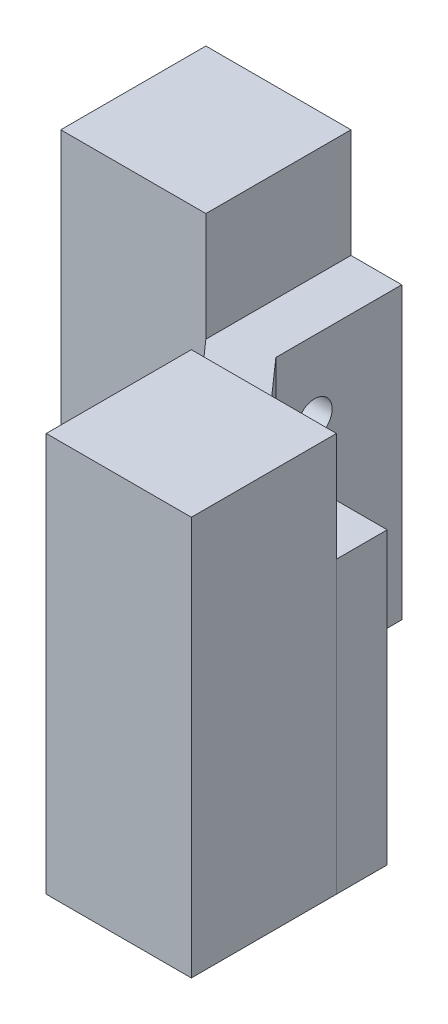
ISO-10303-21;
HEADER;
FILE_DESCRIPTION(('STEP AP214'),'2;1');
FILE_NAME('part.step','',(''),(''),'','','');
FILE_SCHEMA(('AUTOMOTIVE_DESIGN { 1 0 10303 214 1 1 1 1 }'));
ENDSEC;
DATA;
#1=APPLICATION_CONTEXT('core data for automotive mechanical design processes');
#2=APPLICATION_PROTOCOL_DEFINITION('international standard','automotive_design',2000,#1);
#3=PRODUCT_CONTEXT('',#1,'mechanical');
#4=PRODUCT('Part','Part','',(#3));
#5=PRODUCT_RELATED_PRODUCT_CATEGORY('part','',(#4));
#6=PRODUCT_DEFINITION_FORMATION('','',#4);
#7=PRODUCT_DEFINITION_CONTEXT('part definition',#1,'design');
#8=PRODUCT_DEFINITION('design','',#6,#7);
#9=PRODUCT_DEFINITION_SHAPE('','',#8);
#10=(LENGTH_UNIT() NAMED_UNIT(*) SI_UNIT(.MILLI.,.METRE.));
#11=(NAMED_UNIT(*) PLANE_ANGLE_UNIT() SI_UNIT($,.RADIAN.));
#12=(NAMED_UNIT(*) SI_UNIT($,.STERADIAN.) SOLID_ANGLE_UNIT());
#13=UNCERTAINTY_MEASURE_WITH_UNIT(LENGTH_MEASURE(1.E-05),#10,'distance_accuracy_value','');
#14=(GEOMETRIC_REPRESENTATION_CONTEXT(3) GLOBAL_UNCERTAINTY_ASSIGNED_CONTEXT((#13)) GLOBAL_UNIT_ASSIGNED_CONTEXT((#10,
#11,#12)) REPRESENTATION_CONTEXT('',''));
#15=CARTESIAN_POINT('',(0.,0.,0.));
#16=DIRECTION('',(0.,0.,1.));
#17=DIRECTION('',(1.,0.,0.));
#18=AXIS2_PLACEMENT_3D('',#15,#16,#17);
#19=CARTESIAN_POINT('',(15.25,40.,17.25));
#20=DIRECTION('',(0.,0.,-1.));
#21=DIRECTION('',(-1.,0.,0.));
#22=AXIS2_PLACEMENT_3D('',#19,#20,#21);
#23=PLANE('',#22);
#24=CARTESIAN_POINT('',(25.25,30.,17.25));
#25=DIRECTION('',(0.,0.,-1.));
#26=DIRECTION('',(-1.,0.,0.));
#27=AXIS2_PLACEMENT_3D('',#24,#25,#26);
#28=CIRCLE('',#27,2.4);
#29=CARTESIAN_POINT('',(22.85,30.,17.25));
#30=VERTEX_POINT('',#29);
#31=EDGE_CURVE('E229',#30,#30,#28,.T.);
#32=ORIENTED_EDGE('',*,*,#31,.T.);
#33=EDGE_LOOP('',(#32));
#34=FACE_BOUND('',#33,.T.);
#35=CARTESIAN_POINT('',(25.25,10.,17.25));
#36=DIRECTION('',(0.,0.,-1.));
#37=DIRECTION('',(-1.,0.,0.));
#38=AXIS2_PLACEMENT_3D('',#35,#36,#37);
#39=CIRCLE('',#38,2.4);
#40=CARTESIAN_POINT('',(22.85,10.,17.25));
#41=VERTEX_POINT('',#40);
#42=EDGE_CURVE('E162',#41,#41,#39,.T.);
#43=ORIENTED_EDGE('',*,*,#42,.T.);
#44=EDGE_LOOP('',(#43));
#45=FACE_BOUND('',#44,.T.);
#46=DIRECTION('',(1.,0.,0.));
#47=VECTOR('',#46,1.);
#48=CARTESIAN_POINT('',(15.25,0.,17.25));
#49=LINE('',#48,#47);
#50=CARTESIAN_POINT('',(15.25,0.,17.25));
#51=VERTEX_POINT('',#50);
#52=CARTESIAN_POINT('',(35.25,0.,17.25));
#53=VERTEX_POINT('',#52);
#54=EDGE_CURVE('E157',#51,#53,#49,.T.);
#55=ORIENTED_EDGE('',*,*,#54,.T.);
#56=DIRECTION('',(0.,-1.,0.));
#57=VECTOR('',#56,1.);
#58=CARTESIAN_POINT('',(35.25,40.,17.25));
#59=LINE('',#58,#57);
#60=CARTESIAN_POINT('',(35.25,40.,17.25));
#61=VERTEX_POINT('',#60);
#62=EDGE_CURVE('E12',#61,#53,#59,.T.);
#63=ORIENTED_EDGE('',*,*,#62,.F.);
#64=DIRECTION('',(1.,0.,0.));
#65=VECTOR('',#64,1.);
#66=CARTESIAN_POINT('',(15.25,40.,17.25));
#67=LINE('',#66,#65);
#68=CARTESIAN_POINT('',(15.25,40.,17.25));
#69=VERTEX_POINT('',#68);
#70=EDGE_CURVE('E108',#69,#61,#67,.T.);
#71=ORIENTED_EDGE('',*,*,#70,.F.);
#72=DIRECTION('',(0.,-1.,0.));
#73=VECTOR('',#72,1.);
#74=CARTESIAN_POINT('',(15.25,40.,17.25));
#75=LINE('',#74,#73);
#76=EDGE_CURVE('E156',#69,#51,#75,.T.);
#77=ORIENTED_EDGE('',*,*,#76,.T.);
#78=EDGE_LOOP('',(#55,#63,#71,#77));
#79=FACE_BOUND('',#78,.T.);
#80=ADVANCED_FACE('F52',(#34,#45,#79),#23,.F.);
#81=CARTESIAN_POINT('',(35.25,40.,10.25));
#82=DIRECTION('',(1.,0.,0.));
#83=DIRECTION('',(0.,0.,-1.));
#84=AXIS2_PLACEMENT_3D('',#81,#82,#83);
#85=PLANE('',#84);
#86=DIRECTION('',(0.,0.,1.));
#87=VECTOR('',#86,1.);
#88=CARTESIAN_POINT('',(35.25,0.,10.25));
#89=LINE('',#88,#87);
#90=CARTESIAN_POINT('',(35.25,0.,10.25));
#91=VERTEX_POINT('',#90);
#92=EDGE_CURVE('E161',#91,#53,#89,.T.);
#93=ORIENTED_EDGE('',*,*,#92,.F.);
#94=DIRECTION('',(0.,-1.,0.));
#95=VECTOR('',#94,1.);
#96=CARTESIAN_POINT('',(35.25,40.,10.25));
#97=LINE('',#96,#95);
#98=CARTESIAN_POINT('',(35.25,40.,10.25));
#99=VERTEX_POINT('',#98);
#100=EDGE_CURVE('E61',#99,#91,#97,.T.);
#101=ORIENTED_EDGE('',*,*,#100,.F.);
#102=DIRECTION('',(0.,0.,1.));
#103=VECTOR('',#102,1.);
#104=CARTESIAN_POINT('',(35.25,40.,10.25));
#105=LINE('',#104,#103);
#106=EDGE_CURVE('E213',#99,#61,#105,.T.);
#107=ORIENTED_EDGE('',*,*,#106,.T.);
#108=ORIENTED_EDGE('',*,*,#62,.T.);
#109=EDGE_LOOP('',(#93,#101,#107,#108));
#110=FACE_BOUND('',#109,.T.);
#111=ADVANCED_FACE('F204',(#110),#85,.T.);
#112=CARTESIAN_POINT('',(15.25,40.,10.25));
#113=DIRECTION('',(0.,0.,-1.));
#114=DIRECTION('',(-1.,0.,0.));
#115=AXIS2_PLACEMENT_3D('',#112,#113,#114);
#116=PLANE('',#115);
#117=CARTESIAN_POINT('',(25.25,30.,10.25));
#118=DIRECTION('',(0.,0.,-1.));
#119=DIRECTION('',(-1.,0.,0.));
#120=AXIS2_PLACEMENT_3D('',#117,#118,#119);
#121=CIRCLE('',#120,2.4);
#122=CARTESIAN_POINT('',(22.85,30.,10.25));
#123=VERTEX_POINT('',#122);
#124=EDGE_CURVE('E233',#123,#123,#121,.T.);
#125=ORIENTED_EDGE('',*,*,#124,.F.);
#126=EDGE_LOOP('',(#125));
#127=FACE_BOUND('',#126,.T.);
#128=CARTESIAN_POINT('',(25.25,10.,10.25));
#129=DIRECTION('',(0.,0.,-1.));
#130=DIRECTION('',(-1.,0.,0.));
#131=AXIS2_PLACEMENT_3D('',#128,#129,#130);
#132=CIRCLE('',#131,2.4);
#133=CARTESIAN_POINT('',(22.85,10.,10.25));
#134=VERTEX_POINT('',#133);
#135=EDGE_CURVE('E226',#134,#134,#132,.T.);
#136=ORIENTED_EDGE('',*,*,#135,.F.);
#137=EDGE_LOOP('',(#136));
#138=FACE_BOUND('',#137,.T.);
#139=DIRECTION('',(1.,0.,0.));
#140=VECTOR('',#139,1.);
#141=CARTESIAN_POINT('',(15.25,0.,10.25));
#142=LINE('',#141,#140);
#143=CARTESIAN_POINT('',(18.4048466510345,0.,10.25));
#144=VERTEX_POINT('',#143);
#145=EDGE_CURVE('E166',#144,#91,#142,.T.);
#146=ORIENTED_EDGE('',*,*,#145,.F.);
#147=DIRECTION('',(0.,-1.,0.));
#148=VECTOR('',#147,1.);
#149=CARTESIAN_POINT('',(18.4048466510345,40.,10.25));
#150=LINE('',#149,#148);
#151=CARTESIAN_POINT('',(18.4048466510345,40.,10.25));
#152=VERTEX_POINT('',#151);
#153=EDGE_CURVE('E192',#152,#144,#150,.T.);
#154=ORIENTED_EDGE('',*,*,#153,.F.);
#155=DIRECTION('',(1.,0.,0.));
#156=VECTOR('',#155,1.);
#157=CARTESIAN_POINT('',(15.25,40.,10.25));
#158=LINE('',#157,#156);
#159=EDGE_CURVE('E201',#152,#99,#158,.T.);
#160=ORIENTED_EDGE('',*,*,#159,.T.);
#161=ORIENTED_EDGE('',*,*,#100,.T.);
#162=EDGE_LOOP('',(#146,#154,#160,#161));
#163=FACE_BOUND('',#162,.T.);
#164=ADVANCED_FACE('F199',(#127,#138,#163),#116,.T.);
#165=CARTESIAN_POINT('',(5.24442642131282,40.,-4.63637698116061));
#166=DIRECTION('',(0.74920377447326,0.,-0.66233956873723));
#167=DIRECTION('',(-0.66233956873723,0.,-0.74920377447326));
#168=AXIS2_PLACEMENT_3D('',#165,#166,#167);
#169=PLANE('',#168);
#170=DIRECTION('',(0.66233956873723,0.,0.74920377447326));
#171=VECTOR('',#170,1.);
#172=CARTESIAN_POINT('',(5.24442642131282,0.,-4.63637698116061));
#173=LINE('',#172,#171);
#174=CARTESIAN_POINT('',(7.,0.,-2.65056424461282));
#175=VERTEX_POINT('',#174);
#176=EDGE_CURVE('E170',#175,#144,#173,.T.);
#177=ORIENTED_EDGE('',*,*,#176,.F.);
#178=DIRECTION('',(0.,-1.,0.));
#179=VECTOR('',#178,1.);
#180=CARTESIAN_POINT('',(7.,40.,-2.65056424461282));
#181=LINE('',#180,#179);
#182=CARTESIAN_POINT('',(7.,40.,-2.65056424461282));
#183=VERTEX_POINT('',#182);
#184=EDGE_CURVE('E189',#183,#175,#181,.T.);
#185=ORIENTED_EDGE('',*,*,#184,.F.);
#186=DIRECTION('',(0.66233956873723,0.,0.74920377447326));
#187=VECTOR('',#186,1.);
#188=CARTESIAN_POINT('',(5.24442642131282,40.,-4.63637698116061));
#189=LINE('',#188,#187);
#190=EDGE_CURVE('E150',#183,#152,#189,.T.);
#191=ORIENTED_EDGE('',*,*,#190,.T.);
#192=ORIENTED_EDGE('',*,*,#153,.T.);
#193=EDGE_LOOP('',(#177,#185,#191,#192));
#194=FACE_BOUND('',#193,.T.);
#195=ADVANCED_FACE('F211',(#194),#169,.T.);
#196=CARTESIAN_POINT('',(7.,40.,-20.));
#197=DIRECTION('',(1.,0.,0.));
#198=DIRECTION('',(0.,0.,-1.));
#199=AXIS2_PLACEMENT_3D('',#196,#197,#198);
#200=PLANE('',#199);
#201=CARTESIAN_POINT('',(7.,30.,-7.99999999999999));
#202=DIRECTION('',(1.,0.,0.));
#203=DIRECTION('',(0.,0.,-1.));
#204=AXIS2_PLACEMENT_3D('',#201,#202,#203);
#205=CIRCLE('',#204,2.4);
#206=CARTESIAN_POINT('',(7.00000000000001,30.,-10.4));
#207=VERTEX_POINT('',#206);
#208=EDGE_CURVE('E249',#207,#207,#205,.T.);
#209=ORIENTED_EDGE('',*,*,#208,.F.);
#210=EDGE_LOOP('',(#209));
#211=FACE_BOUND('',#210,.T.);
#212=CARTESIAN_POINT('',(7.,10.,-7.99999999999999));
#213=DIRECTION('',(1.,0.,0.));
#214=DIRECTION('',(0.,0.,-1.));
#215=AXIS2_PLACEMENT_3D('',#212,#213,#214);
#216=CIRCLE('',#215,2.4);
#217=CARTESIAN_POINT('',(7.00000000000001,10.,-10.4));
#218=VERTEX_POINT('',#217);
#219=EDGE_CURVE('E241',#218,#218,#216,.T.);
#220=ORIENTED_EDGE('',*,*,#219,.F.);
#221=EDGE_LOOP('',(#220));
#222=FACE_BOUND('',#221,.T.);
#223=DIRECTION('',(0.,0.,1.));
#224=VECTOR('',#223,1.);
#225=CARTESIAN_POINT('',(7.,0.,-20.));
#226=LINE('',#225,#224);
#227=CARTESIAN_POINT('',(7.,0.,-20.));
#228=VERTEX_POINT('',#227);
#229=EDGE_CURVE('E174',#228,#175,#226,.T.);
#230=ORIENTED_EDGE('',*,*,#229,.F.);
#231=DIRECTION('',(0.,-1.,0.));
#232=VECTOR('',#231,1.);
#233=CARTESIAN_POINT('',(7.,40.,-20.));
#234=LINE('',#233,#232);
#235=CARTESIAN_POINT('',(7.,40.,-20.));
#236=VERTEX_POINT('',#235);
#237=EDGE_CURVE('E133',#236,#228,#234,.T.);
#238=ORIENTED_EDGE('',*,*,#237,.F.);
#239=DIRECTION('',(0.,0.,1.));
#240=VECTOR('',#239,1.);
#241=CARTESIAN_POINT('',(7.,40.,-20.));
#242=LINE('',#241,#240);
#243=EDGE_CURVE('E144',#236,#183,#242,.T.);
#244=ORIENTED_EDGE('',*,*,#243,.T.);
#245=ORIENTED_EDGE('',*,*,#184,.T.);
#246=EDGE_LOOP('',(#230,#238,#244,#245));
#247=FACE_BOUND('',#246,.T.);
#248=ADVANCED_FACE('F255',(#211,#222,#247),#200,.T.);
#249=CARTESIAN_POINT('',(0.,40.,-20.));
#250=DIRECTION('',(0.,0.,-1.));
#251=DIRECTION('',(-1.,0.,0.));
#252=AXIS2_PLACEMENT_3D('',#249,#250,#251);
#253=PLANE('',#252);
#254=DIRECTION('',(1.,0.,0.));
#255=VECTOR('',#254,1.);
#256=CARTESIAN_POINT('',(0.,0.,-20.));
#257=LINE('',#256,#255);
#258=CARTESIAN_POINT('',(0.,0.,-20.));
#259=VERTEX_POINT('',#258);
#260=EDGE_CURVE('E131',#259,#228,#257,.T.);
#261=ORIENTED_EDGE('',*,*,#260,.F.);
#262=DIRECTION('',(0.,-1.,0.));
#263=VECTOR('',#262,1.);
#264=CARTESIAN_POINT('',(0.,40.,-20.));
#265=LINE('',#264,#263);
#266=CARTESIAN_POINT('',(0.,40.,-20.));
#267=VERTEX_POINT('',#266);
#268=EDGE_CURVE('E125',#267,#259,#265,.T.);
#269=ORIENTED_EDGE('',*,*,#268,.F.);
#270=DIRECTION('',(1.,0.,0.));
#271=VECTOR('',#270,1.);
#272=CARTESIAN_POINT('',(0.,40.,-20.));
#273=LINE('',#272,#271);
#274=EDGE_CURVE('E129',#267,#236,#273,.T.);
#275=ORIENTED_EDGE('',*,*,#274,.T.);
#276=ORIENTED_EDGE('',*,*,#237,.T.);
#277=EDGE_LOOP('',(#261,#269,#275,#276));
#278=FACE_BOUND('',#277,.T.);
#279=ADVANCED_FACE('F127',(#278),#253,.T.);
#280=CARTESIAN_POINT('',(0.,40.,-20.));
#281=DIRECTION('',(1.,0.,0.));
#282=DIRECTION('',(0.,0.,-1.));
#283=AXIS2_PLACEMENT_3D('',#280,#281,#282);
#284=PLANE('',#283);
#285=CARTESIAN_POINT('',(0.,30.,-8.));
#286=DIRECTION('',(1.,0.,0.));
#287=DIRECTION('',(0.,0.,-1.));
#288=AXIS2_PLACEMENT_3D('',#285,#286,#287);
#289=CIRCLE('',#288,2.4);
#290=CARTESIAN_POINT('',(0.,30.,-10.4));
#291=VERTEX_POINT('',#290);
#292=EDGE_CURVE('E245',#291,#291,#289,.T.);
#293=ORIENTED_EDGE('',*,*,#292,.T.);
#294=EDGE_LOOP('',(#293));
#295=FACE_BOUND('',#294,.T.);
#296=CARTESIAN_POINT('',(0.,10.,-8.));
#297=DIRECTION('',(1.,0.,0.));
#298=DIRECTION('',(0.,0.,-1.));
#299=AXIS2_PLACEMENT_3D('',#296,#297,#298);
#300=CIRCLE('',#299,2.4);
#301=CARTESIAN_POINT('',(0.,10.,-10.4));
#302=VERTEX_POINT('',#301);
#303=EDGE_CURVE('E237',#302,#302,#300,.T.);
#304=ORIENTED_EDGE('',*,*,#303,.T.);
#305=EDGE_LOOP('',(#304));
#306=FACE_BOUND('',#305,.T.);
#307=DIRECTION('',(0.,0.,1.));
#308=VECTOR('',#307,1.);
#309=CARTESIAN_POINT('',(0.,0.,-20.));
#310=LINE('',#309,#308);
#311=CARTESIAN_POINT('',(0.,0.,0.));
#312=VERTEX_POINT('',#311);
#313=EDGE_CURVE('E96',#259,#312,#310,.T.);
#314=ORIENTED_EDGE('',*,*,#313,.T.);
#315=DIRECTION('',(0.,-1.,0.));
#316=VECTOR('',#315,1.);
#317=CARTESIAN_POINT('',(0.,40.,0.));
#318=LINE('',#317,#316);
#319=CARTESIAN_POINT('',(0.,40.,0.));
#320=VERTEX_POINT('',#319);
#321=EDGE_CURVE('E134',#320,#312,#318,.T.);
#322=ORIENTED_EDGE('',*,*,#321,.F.);
#323=DIRECTION('',(0.,0.,1.));
#324=VECTOR('',#323,1.);
#325=CARTESIAN_POINT('',(0.,40.,-20.));
#326=LINE('',#325,#324);
#327=EDGE_CURVE('E136',#267,#320,#326,.T.);
#328=ORIENTED_EDGE('',*,*,#327,.F.);
#329=ORIENTED_EDGE('',*,*,#268,.T.);
#330=EDGE_LOOP('',(#314,#322,#328,#329));
#331=FACE_BOUND('',#330,.T.);
#332=ADVANCED_FACE('F137',(#295,#306,#331),#284,.F.);
#333=CARTESIAN_POINT('',(0.,40.,0.));
#334=DIRECTION('',(0.74920377447326,0.,-0.66233956873723));
#335=DIRECTION('',(-0.66233956873723,0.,-0.74920377447326));
#336=AXIS2_PLACEMENT_3D('',#333,#334,#335);
#337=PLANE('',#336);
#338=DIRECTION('',(0.66233956873723,0.,0.74920377447326));
#339=VECTOR('',#338,1.);
#340=CARTESIAN_POINT('',(0.,0.,0.));
#341=LINE('',#340,#339);
#342=EDGE_CURVE('E102',#312,#51,#341,.T.);
#343=ORIENTED_EDGE('',*,*,#342,.T.);
#344=ORIENTED_EDGE('',*,*,#76,.F.);
#345=DIRECTION('',(0.66233956873723,0.,0.74920377447326));
#346=VECTOR('',#345,1.);
#347=CARTESIAN_POINT('',(0.,40.,0.));
#348=LINE('',#347,#346);
#349=EDGE_CURVE('E69',#320,#69,#348,.T.);
#350=ORIENTED_EDGE('',*,*,#349,.F.);
#351=ORIENTED_EDGE('',*,*,#321,.T.);
#352=EDGE_LOOP('',(#343,#344,#350,#351));
#353=FACE_BOUND('',#352,.T.);
#354=ADVANCED_FACE('F262',(#353),#337,.F.);
#355=CARTESIAN_POINT('',(0.,40.,0.));
#356=DIRECTION('',(0.,-1.,0.));
#357=DIRECTION('',(-1.,0.,0.));
#358=AXIS2_PLACEMENT_3D('',#355,#356,#357);
#359=PLANE('',#358);
#360=ORIENTED_EDGE('',*,*,#70,.T.);
#361=ORIENTED_EDGE('',*,*,#106,.F.);
#362=ORIENTED_EDGE('',*,*,#159,.F.);
#363=ORIENTED_EDGE('',*,*,#190,.F.);
#364=ORIENTED_EDGE('',*,*,#243,.F.);
#365=ORIENTED_EDGE('',*,*,#274,.F.);
#366=ORIENTED_EDGE('',*,*,#327,.T.);
#367=ORIENTED_EDGE('',*,*,#349,.T.);
#368=EDGE_LOOP('',(#360,#361,#362,#363,#364,#365,#366,#367));
#369=FACE_BOUND('',#368,.T.);
#370=ADVANCED_FACE('F141',(#369),#359,.F.);
#371=CARTESIAN_POINT('',(0.,0.,0.));
#372=DIRECTION('',(0.,-1.,0.));
#373=DIRECTION('',(-1.,0.,0.));
#374=AXIS2_PLACEMENT_3D('',#371,#372,#373);
#375=PLANE('',#374);
#376=ORIENTED_EDGE('',*,*,#54,.F.);
#377=ORIENTED_EDGE('',*,*,#342,.F.);
#378=ORIENTED_EDGE('',*,*,#313,.F.);
#379=ORIENTED_EDGE('',*,*,#260,.T.);
#380=ORIENTED_EDGE('',*,*,#229,.T.);
#381=ORIENTED_EDGE('',*,*,#176,.T.);
#382=ORIENTED_EDGE('',*,*,#145,.T.);
#383=ORIENTED_EDGE('',*,*,#92,.T.);
#384=EDGE_LOOP('',(#376,#377,#378,#379,#380,#381,#382,#383));
#385=FACE_BOUND('',#384,.T.);
#386=ADVANCED_FACE('F207',(#385),#375,.T.);
#387=CARTESIAN_POINT('',(25.25,10.,10.25));
#388=DIRECTION('',(0.,0.,-1.));
#389=DIRECTION('',(-1.,0.,0.));
#390=AXIS2_PLACEMENT_3D('',#387,#388,#389);
#391=CYLINDRICAL_SURFACE('',#390,2.4);
#392=ORIENTED_EDGE('',*,*,#135,.T.);
#393=EDGE_LOOP('',(#392));
#394=FACE_BOUND('',#393,.T.);
#395=ORIENTED_EDGE('',*,*,#42,.F.);
#396=EDGE_LOOP('',(#395));
#397=FACE_BOUND('',#396,.T.);
#398=ADVANCED_FACE('F282',(#394,#397),#391,.F.);
#399=CARTESIAN_POINT('',(25.25,30.,10.25));
#400=DIRECTION('',(0.,0.,-1.));
#401=DIRECTION('',(-1.,0.,0.));
#402=AXIS2_PLACEMENT_3D('',#399,#400,#401);
#403=CYLINDRICAL_SURFACE('',#402,2.4);
#404=ORIENTED_EDGE('',*,*,#124,.T.);
#405=EDGE_LOOP('',(#404));
#406=FACE_BOUND('',#405,.T.);
#407=ORIENTED_EDGE('',*,*,#31,.F.);
#408=EDGE_LOOP('',(#407));
#409=FACE_BOUND('',#408,.T.);
#410=ADVANCED_FACE('F284',(#406,#409),#403,.F.);
#411=CARTESIAN_POINT('',(7.,10.,-7.99999999999999));
#412=DIRECTION('',(1.,0.,0.));
#413=DIRECTION('',(0.,0.,-1.));
#414=AXIS2_PLACEMENT_3D('',#411,#412,#413);
#415=CYLINDRICAL_SURFACE('',#414,2.4);
#416=ORIENTED_EDGE('',*,*,#303,.F.);
#417=EDGE_LOOP('',(#416));
#418=FACE_BOUND('',#417,.T.);
#419=ORIENTED_EDGE('',*,*,#219,.T.);
#420=EDGE_LOOP('',(#419));
#421=FACE_BOUND('',#420,.T.);
#422=ADVANCED_FACE('F291',(#418,#421),#415,.F.);
#423=CARTESIAN_POINT('',(7.,30.,-7.99999999999999));
#424=DIRECTION('',(1.,0.,0.));
#425=DIRECTION('',(0.,0.,-1.));
#426=AXIS2_PLACEMENT_3D('',#423,#424,#425);
#427=CYLINDRICAL_SURFACE('',#426,2.4);
#428=ORIENTED_EDGE('',*,*,#292,.F.);
#429=EDGE_LOOP('',(#428));
#430=FACE_BOUND('',#429,.T.);
#431=ORIENTED_EDGE('',*,*,#208,.T.);
#432=EDGE_LOOP('',(#431));
#433=FACE_BOUND('',#432,.T.);
#434=ADVANCED_FACE('F253',(#430,#433),#427,.F.);
#435=CLOSED_SHELL('',(#80,#111,#164,#195,#248,#279,#332,#354,#370,#386,#398,#410,#422,#434));
#436=MANIFOLD_SOLID_BREP('B2',#435);
#437=CARTESIAN_POINT('',(15.25,55.,17.25));
#438=DIRECTION('',(1.,0.,0.));
#439=DIRECTION('',(0.,0.,-1.));
#440=AXIS2_PLACEMENT_3D('',#437,#438,#439);
#441=PLANE('',#440);
#442=DIRECTION('',(0.,0.,1.));
#443=VECTOR('',#442,1.);
#444=CARTESIAN_POINT('',(15.25,0.,17.25));
#445=LINE('',#444,#443);
#446=CARTESIAN_POINT('',(15.25,0.,17.25));
#447=VERTEX_POINT('',#446);
#448=CARTESIAN_POINT('',(15.25,0.,37.25));
#449=VERTEX_POINT('',#448);
#450=EDGE_CURVE('E482',#447,#449,#445,.T.);
#451=ORIENTED_EDGE('',*,*,#450,.T.);
#452=DIRECTION('',(0.,-1.,0.));
#453=VECTOR('',#452,1.);
#454=CARTESIAN_POINT('',(15.25,55.,37.25));
#455=LINE('',#454,#453);
#456=CARTESIAN_POINT('',(15.25,55.,37.25));
#457=VERTEX_POINT('',#456);
#458=EDGE_CURVE('E50',#457,#449,#455,.T.);
#459=ORIENTED_EDGE('',*,*,#458,.F.);
#460=DIRECTION('',(0.,0.,1.));
#461=VECTOR('',#460,1.);
#462=CARTESIAN_POINT('',(15.25,55.,17.25));
#463=LINE('',#462,#461);
#464=CARTESIAN_POINT('',(15.25,55.,17.25));
#465=VERTEX_POINT('',#464);
#466=EDGE_CURVE('E470',#465,#457,#463,.T.);
#467=ORIENTED_EDGE('',*,*,#466,.F.);
#468=DIRECTION('',(0.,-1.,0.));
#469=VECTOR('',#468,1.);
#470=CARTESIAN_POINT('',(15.25,55.,17.25));
#471=LINE('',#470,#469);
#472=EDGE_CURVE('E478',#465,#447,#471,.T.);
#473=ORIENTED_EDGE('',*,*,#472,.T.);
#474=EDGE_LOOP('',(#451,#459,#467,#473));
#475=FACE_BOUND('',#474,.T.);
#476=ADVANCED_FACE('F419',(#475),#441,.F.);
#477=CARTESIAN_POINT('',(15.25,55.,37.25));
#478=DIRECTION('',(0.,0.,-1.));
#479=DIRECTION('',(-1.,0.,0.));
#480=AXIS2_PLACEMENT_3D('',#477,#478,#479);
#481=PLANE('',#480);
#482=DIRECTION('',(1.,0.,0.));
#483=VECTOR('',#482,1.);
#484=CARTESIAN_POINT('',(15.25,0.,37.25));
#485=LINE('',#484,#483);
#486=CARTESIAN_POINT('',(35.25,0.,37.25));
#487=VERTEX_POINT('',#486);
#488=EDGE_CURVE('E474',#449,#487,#485,.T.);
#489=ORIENTED_EDGE('',*,*,#488,.T.);
#490=DIRECTION('',(0.,-1.,0.));
#491=VECTOR('',#490,1.);
#492=CARTESIAN_POINT('',(35.25,55.,37.25));
#493=LINE('',#492,#491);
#494=CARTESIAN_POINT('',(35.25,55.,37.25));
#495=VERTEX_POINT('',#494);
#496=EDGE_CURVE('E427',#495,#487,#493,.T.);
#497=ORIENTED_EDGE('',*,*,#496,.F.);
#498=DIRECTION('',(1.,0.,0.));
#499=VECTOR('',#498,1.);
#500=CARTESIAN_POINT('',(15.25,55.,37.25));
#501=LINE('',#500,#499);
#502=EDGE_CURVE('E465',#457,#495,#501,.T.);
#503=ORIENTED_EDGE('',*,*,#502,.F.);
#504=ORIENTED_EDGE('',*,*,#458,.T.);
#505=EDGE_LOOP('',(#489,#497,#503,#504));
#506=FACE_BOUND('',#505,.T.);
#507=ADVANCED_FACE('F473',(#506),#481,.F.);
#508=CARTESIAN_POINT('',(35.25,55.,17.25));
#509=DIRECTION('',(-1.,0.,0.));
#510=DIRECTION('',(0.,0.,1.));
#511=AXIS2_PLACEMENT_3D('',#508,#509,#510);
#512=PLANE('',#511);
#513=DIRECTION('',(0.,0.,-1.));
#514=VECTOR('',#513,1.);
#515=CARTESIAN_POINT('',(35.25,0.,17.25));
#516=LINE('',#515,#514);
#517=CARTESIAN_POINT('',(35.25,0.,17.25));
#518=VERTEX_POINT('',#517);
#519=EDGE_CURVE('E452',#487,#518,#516,.T.);
#520=ORIENTED_EDGE('',*,*,#519,.T.);
#521=DIRECTION('',(0.,-1.,0.));
#522=VECTOR('',#521,1.);
#523=CARTESIAN_POINT('',(35.25,55.,17.25));
#524=LINE('',#523,#522);
#525=CARTESIAN_POINT('',(35.25,55.,17.25));
#526=VERTEX_POINT('',#525);
#527=EDGE_CURVE('E475',#526,#518,#524,.T.);
#528=ORIENTED_EDGE('',*,*,#527,.F.);
#529=DIRECTION('',(0.,0.,-1.));
#530=VECTOR('',#529,1.);
#531=CARTESIAN_POINT('',(35.25,55.,17.25));
#532=LINE('',#531,#530);
#533=EDGE_CURVE('E468',#495,#526,#532,.T.);
#534=ORIENTED_EDGE('',*,*,#533,.F.);
#535=ORIENTED_EDGE('',*,*,#496,.T.);
#536=EDGE_LOOP('',(#520,#528,#534,#535));
#537=FACE_BOUND('',#536,.T.);
#538=ADVANCED_FACE('F476',(#537),#512,.F.);
#539=CARTESIAN_POINT('',(15.25,55.,17.25));
#540=DIRECTION('',(0.,0.,1.));
#541=DIRECTION('',(1.,0.,0.));
#542=AXIS2_PLACEMENT_3D('',#539,#540,#541);
#543=PLANE('',#542);
#544=DIRECTION('',(-1.,0.,0.));
#545=VECTOR('',#544,1.);
#546=CARTESIAN_POINT('',(15.25,0.,17.25));
#547=LINE('',#546,#545);
#548=EDGE_CURVE('E458',#518,#447,#547,.T.);
#549=ORIENTED_EDGE('',*,*,#548,.T.);
#550=ORIENTED_EDGE('',*,*,#472,.F.);
#551=DIRECTION('',(-1.,0.,0.));
#552=VECTOR('',#551,1.);
#553=CARTESIAN_POINT('',(15.25,55.,17.25));
#554=LINE('',#553,#552);
#555=EDGE_CURVE('E435',#526,#465,#554,.T.);
#556=ORIENTED_EDGE('',*,*,#555,.F.);
#557=ORIENTED_EDGE('',*,*,#527,.T.);
#558=EDGE_LOOP('',(#549,#550,#556,#557));
#559=FACE_BOUND('',#558,.T.);
#560=ADVANCED_FACE('F489',(#559),#543,.F.);
#561=CARTESIAN_POINT('',(0.,55.,0.));
#562=DIRECTION('',(0.,1.,0.));
#563=DIRECTION('',(0.,0.,1.));
#564=AXIS2_PLACEMENT_3D('',#561,#562,#563);
#565=PLANE('',#564);
#566=ORIENTED_EDGE('',*,*,#466,.T.);
#567=ORIENTED_EDGE('',*,*,#502,.T.);
#568=ORIENTED_EDGE('',*,*,#533,.T.);
#569=ORIENTED_EDGE('',*,*,#555,.T.);
#570=EDGE_LOOP('',(#566,#567,#568,#569));
#571=FACE_BOUND('',#570,.T.);
#572=ADVANCED_FACE('F466',(#571),#565,.T.);
#573=CARTESIAN_POINT('',(0.,0.,0.));
#574=DIRECTION('',(0.,1.,0.));
#575=DIRECTION('',(0.,0.,1.));
#576=AXIS2_PLACEMENT_3D('',#573,#574,#575);
#577=PLANE('',#576);
#578=ORIENTED_EDGE('',*,*,#450,.F.);
#579=ORIENTED_EDGE('',*,*,#548,.F.);
#580=ORIENTED_EDGE('',*,*,#519,.F.);
#581=ORIENTED_EDGE('',*,*,#488,.F.);
#582=EDGE_LOOP('',(#578,#579,#580,#581));
#583=FACE_BOUND('',#582,.T.);
#584=ADVANCED_FACE('F492',(#583),#577,.F.);
#585=CLOSED_SHELL('',(#476,#507,#538,#560,#572,#584));
#586=MANIFOLD_SOLID_BREP('B6_NOT_SHOWN',#585);
#587=CARTESIAN_POINT('',(0.,55.,0.));
#588=DIRECTION('',(-1.,0.,0.));
#589=DIRECTION('',(0.,0.,1.));
#590=AXIS2_PLACEMENT_3D('',#587,#588,#589);
#591=PLANE('',#590);
#592=DIRECTION('',(0.,0.,-1.));
#593=VECTOR('',#592,1.);
#594=CARTESIAN_POINT('',(0.,0.,0.));
#595=LINE('',#594,#593);
#596=CARTESIAN_POINT('',(0.,0.,0.));
#597=VERTEX_POINT('',#596);
#598=CARTESIAN_POINT('',(0.,0.,-20.));
#599=VERTEX_POINT('',#598);
#600=EDGE_CURVE('E606',#597,#599,#595,.T.);
#601=ORIENTED_EDGE('',*,*,#600,.T.);
#602=DIRECTION('',(0.,-1.,0.));
#603=VECTOR('',#602,1.);
#604=CARTESIAN_POINT('',(0.,55.,-20.));
#605=LINE('',#604,#603);
#606=CARTESIAN_POINT('',(0.,55.,-20.));
#607=VERTEX_POINT('',#606);
#608=EDGE_CURVE('E417',#607,#599,#605,.T.);
#609=ORIENTED_EDGE('',*,*,#608,.F.);
#610=DIRECTION('',(0.,0.,-1.));
#611=VECTOR('',#610,1.);
#612=CARTESIAN_POINT('',(0.,55.,0.));
#613=LINE('',#612,#611);
#614=CARTESIAN_POINT('',(0.,55.,0.));
#615=VERTEX_POINT('',#614);
#616=EDGE_CURVE('E594',#615,#607,#613,.T.);
#617=ORIENTED_EDGE('',*,*,#616,.F.);
#618=DIRECTION('',(0.,-1.,0.));
#619=VECTOR('',#618,1.);
#620=CARTESIAN_POINT('',(0.,55.,0.));
#621=LINE('',#620,#619);
#622=EDGE_CURVE('E602',#615,#597,#621,.T.);
#623=ORIENTED_EDGE('',*,*,#622,.T.);
#624=EDGE_LOOP('',(#601,#609,#617,#623));
#625=FACE_BOUND('',#624,.T.);
#626=ADVANCED_FACE('F543',(#625),#591,.F.);
#627=CARTESIAN_POINT('',(0.,55.,-20.));
#628=DIRECTION('',(0.,0.,1.));
#629=DIRECTION('',(1.,0.,0.));
#630=AXIS2_PLACEMENT_3D('',#627,#628,#629);
#631=PLANE('',#630);
#632=DIRECTION('',(-1.,0.,0.));
#633=VECTOR('',#632,1.);
#634=CARTESIAN_POINT('',(0.,0.,-20.));
#635=LINE('',#634,#633);
#636=CARTESIAN_POINT('',(-20.,0.,-20.));
#637=VERTEX_POINT('',#636);
#638=EDGE_CURVE('E598',#599,#637,#635,.T.);
#639=ORIENTED_EDGE('',*,*,#638,.T.);
#640=DIRECTION('',(0.,-1.,0.));
#641=VECTOR('',#640,1.);
#642=CARTESIAN_POINT('',(-20.,55.,-20.));
#643=LINE('',#642,#641);
#644=CARTESIAN_POINT('',(-20.,55.,-20.));
#645=VERTEX_POINT('',#644);
#646=EDGE_CURVE('E551',#645,#637,#643,.T.);
#647=ORIENTED_EDGE('',*,*,#646,.F.);
#648=DIRECTION('',(-1.,0.,0.));
#649=VECTOR('',#648,1.);
#650=CARTESIAN_POINT('',(0.,55.,-20.));
#651=LINE('',#650,#649);
#652=EDGE_CURVE('E589',#607,#645,#651,.T.);
#653=ORIENTED_EDGE('',*,*,#652,.F.);
#654=ORIENTED_EDGE('',*,*,#608,.T.);
#655=EDGE_LOOP('',(#639,#647,#653,#654));
#656=FACE_BOUND('',#655,.T.);
#657=ADVANCED_FACE('F597',(#656),#631,.F.);
#658=CARTESIAN_POINT('',(-20.,55.,0.));
#659=DIRECTION('',(1.,0.,0.));
#660=DIRECTION('',(0.,0.,-1.));
#661=AXIS2_PLACEMENT_3D('',#658,#659,#660);
#662=PLANE('',#661);
#663=DIRECTION('',(0.,0.,1.));
#664=VECTOR('',#663,1.);
#665=CARTESIAN_POINT('',(-20.,0.,0.));
#666=LINE('',#665,#664);
#667=CARTESIAN_POINT('',(-20.,0.,0.));
#668=VERTEX_POINT('',#667);
#669=EDGE_CURVE('E576',#637,#668,#666,.T.);
#670=ORIENTED_EDGE('',*,*,#669,.T.);
#671=DIRECTION('',(0.,-1.,0.));
#672=VECTOR('',#671,1.);
#673=CARTESIAN_POINT('',(-20.,55.,0.));
#674=LINE('',#673,#672);
#675=CARTESIAN_POINT('',(-20.,55.,0.));
#676=VERTEX_POINT('',#675);
#677=EDGE_CURVE('E599',#676,#668,#674,.T.);
#678=ORIENTED_EDGE('',*,*,#677,.F.);
#679=DIRECTION('',(0.,0.,1.));
#680=VECTOR('',#679,1.);
#681=CARTESIAN_POINT('',(-20.,55.,0.));
#682=LINE('',#681,#680);
#683=EDGE_CURVE('E592',#645,#676,#682,.T.);
#684=ORIENTED_EDGE('',*,*,#683,.F.);
#685=ORIENTED_EDGE('',*,*,#646,.T.);
#686=EDGE_LOOP('',(#670,#678,#684,#685));
#687=FACE_BOUND('',#686,.T.);
#688=ADVANCED_FACE('F600',(#687),#662,.F.);
#689=CARTESIAN_POINT('',(0.,55.,0.));
#690=DIRECTION('',(0.,0.,-1.));
#691=DIRECTION('',(-1.,0.,0.));
#692=AXIS2_PLACEMENT_3D('',#689,#690,#691);
#693=PLANE('',#692);
#694=DIRECTION('',(1.,0.,0.));
#695=VECTOR('',#694,1.);
#696=CARTESIAN_POINT('',(0.,0.,0.));
#697=LINE('',#696,#695);
#698=EDGE_CURVE('E582',#668,#597,#697,.T.);
#699=ORIENTED_EDGE('',*,*,#698,.T.);
#700=ORIENTED_EDGE('',*,*,#622,.F.);
#701=DIRECTION('',(1.,0.,0.));
#702=VECTOR('',#701,1.);
#703=CARTESIAN_POINT('',(0.,55.,0.));
#704=LINE('',#703,#702);
#705=EDGE_CURVE('E559',#676,#615,#704,.T.);
#706=ORIENTED_EDGE('',*,*,#705,.F.);
#707=ORIENTED_EDGE('',*,*,#677,.T.);
#708=EDGE_LOOP('',(#699,#700,#706,#707));
#709=FACE_BOUND('',#708,.T.);
#710=ADVANCED_FACE('F613',(#709),#693,.F.);
#711=CARTESIAN_POINT('',(0.,55.,0.));
#712=DIRECTION('',(0.,1.,0.));
#713=DIRECTION('',(0.,0.,1.));
#714=AXIS2_PLACEMENT_3D('',#711,#712,#713);
#715=PLANE('',#714);
#716=ORIENTED_EDGE('',*,*,#616,.T.);
#717=ORIENTED_EDGE('',*,*,#652,.T.);
#718=ORIENTED_EDGE('',*,*,#683,.T.);
#719=ORIENTED_EDGE('',*,*,#705,.T.);
#720=EDGE_LOOP('',(#716,#717,#718,#719));
#721=FACE_BOUND('',#720,.T.);
#722=ADVANCED_FACE('F590',(#721),#715,.T.);
#723=CARTESIAN_POINT('',(0.,0.,0.));
#724=DIRECTION('',(0.,1.,0.));
#725=DIRECTION('',(0.,0.,1.));
#726=AXIS2_PLACEMENT_3D('',#723,#724,#725);
#727=PLANE('',#726);
#728=ORIENTED_EDGE('',*,*,#600,.F.);
#729=ORIENTED_EDGE('',*,*,#698,.F.);
#730=ORIENTED_EDGE('',*,*,#669,.F.);
#731=ORIENTED_EDGE('',*,*,#638,.F.);
#732=EDGE_LOOP('',(#728,#729,#730,#731));
#733=FACE_BOUND('',#732,.T.);
#734=ADVANCED_FACE('F616',(#733),#727,.F.);
#735=CLOSED_SHELL('',(#626,#657,#688,#710,#722,#734));
#736=MANIFOLD_SOLID_BREP('B44_NOT_SHOWN',#735);
#737=ADVANCED_BREP_SHAPE_REPRESENTATION('',(#18,#436,#586,#736),#14);
#738=SHAPE_DEFINITION_REPRESENTATION(#9,#737);
ENDSEC;
END-ISO-10303-21;
